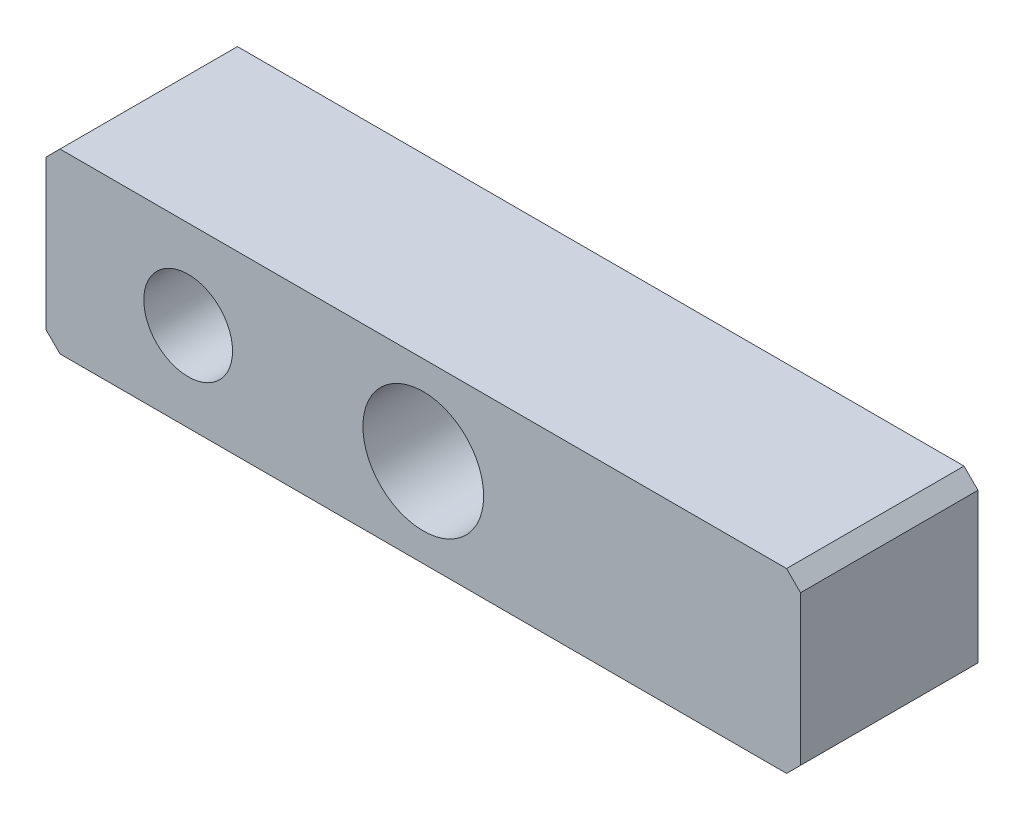
ISO-10303-21;
HEADER;
FILE_DESCRIPTION(('STEP AP214'),'2;1');
FILE_NAME('part.step','',(''),(''),'','','');
FILE_SCHEMA(('AUTOMOTIVE_DESIGN { 1 0 10303 214 1 1 1 1 }'));
ENDSEC;
DATA;
#1=APPLICATION_CONTEXT('core data for automotive mechanical design processes');
#2=APPLICATION_PROTOCOL_DEFINITION('international standard','automotive_design',2000,#1);
#3=PRODUCT_CONTEXT('',#1,'mechanical');
#4=PRODUCT('Part','Part','',(#3));
#5=PRODUCT_RELATED_PRODUCT_CATEGORY('part','',(#4));
#6=PRODUCT_DEFINITION_FORMATION('','',#4);
#7=PRODUCT_DEFINITION_CONTEXT('part definition',#1,'design');
#8=PRODUCT_DEFINITION('design','',#6,#7);
#9=PRODUCT_DEFINITION_SHAPE('','',#8);
#10=(LENGTH_UNIT() NAMED_UNIT(*) SI_UNIT(.MILLI.,.METRE.));
#11=(NAMED_UNIT(*) PLANE_ANGLE_UNIT() SI_UNIT($,.RADIAN.));
#12=(NAMED_UNIT(*) SI_UNIT($,.STERADIAN.) SOLID_ANGLE_UNIT());
#13=UNCERTAINTY_MEASURE_WITH_UNIT(LENGTH_MEASURE(1.E-05),#10,'distance_accuracy_value','');
#14=(GEOMETRIC_REPRESENTATION_CONTEXT(3) GLOBAL_UNCERTAINTY_ASSIGNED_CONTEXT((#13)) GLOBAL_UNIT_ASSIGNED_CONTEXT((#10,
#11,#12)) REPRESENTATION_CONTEXT('',''));
#15=CARTESIAN_POINT('',(0.,0.,0.));
#16=DIRECTION('',(0.,0.,1.));
#17=DIRECTION('',(1.,0.,0.));
#18=AXIS2_PLACEMENT_3D('',#15,#16,#17);
#19=CARTESIAN_POINT('',(0.,6.35,6.35));
#20=DIRECTION('',(0.,0.,-1.));
#21=DIRECTION('',(-1.,0.,0.));
#22=AXIS2_PLACEMENT_3D('',#19,#20,#21);
#23=PLANE('',#22);
#24=DIRECTION('',(0.,-1.,0.));
#25=VECTOR('',#24,1.);
#26=CARTESIAN_POINT('',(0.,0.,6.35));
#27=LINE('',#26,#25);
#28=CARTESIAN_POINT('',(0.,5.85,6.35));
#29=VERTEX_POINT('',#28);
#30=CARTESIAN_POINT('',(0.,0.500000000000004,6.35));
#31=VERTEX_POINT('',#30);
#32=EDGE_CURVE('E136',#29,#31,#27,.T.);
#33=ORIENTED_EDGE('',*,*,#32,.T.);
#34=DIRECTION('',(-0.707106781186545,0.70710678118655,0.));
#35=VECTOR('',#34,1.);
#36=CARTESIAN_POINT('',(0.5,0.,6.35));
#37=LINE('',#36,#35);
#38=CARTESIAN_POINT('',(0.5,0.,6.35));
#39=VERTEX_POINT('',#38);
#40=EDGE_CURVE('E151',#31,#39,#37,.F.);
#41=ORIENTED_EDGE('',*,*,#40,.T.);
#42=DIRECTION('',(1.,0.,0.));
#43=VECTOR('',#42,1.);
#44=CARTESIAN_POINT('',(0.,0.,6.35));
#45=LINE('',#44,#43);
#46=CARTESIAN_POINT('',(26.5,0.,6.35));
#47=VERTEX_POINT('',#46);
#48=EDGE_CURVE('E118',#39,#47,#45,.T.);
#49=ORIENTED_EDGE('',*,*,#48,.T.);
#50=DIRECTION('',(-0.70710678118655,-0.707106781186545,0.));
#51=VECTOR('',#50,1.);
#52=CARTESIAN_POINT('',(27.,0.5,6.35));
#53=LINE('',#52,#51);
#54=CARTESIAN_POINT('',(27.,0.5,6.35));
#55=VERTEX_POINT('',#54);
#56=EDGE_CURVE('E146',#47,#55,#53,.F.);
#57=ORIENTED_EDGE('',*,*,#56,.T.);
#58=DIRECTION('',(0.,1.,0.));
#59=VECTOR('',#58,1.);
#60=CARTESIAN_POINT('',(27.,0.,6.35));
#61=LINE('',#60,#59);
#62=CARTESIAN_POINT('',(27.,5.85,6.35));
#63=VERTEX_POINT('',#62);
#64=EDGE_CURVE('E162',#55,#63,#61,.T.);
#65=ORIENTED_EDGE('',*,*,#64,.T.);
#66=DIRECTION('',(0.707106781186543,-0.707106781186552,0.));
#67=VECTOR('',#66,1.);
#68=CARTESIAN_POINT('',(26.5,6.35,6.35));
#69=LINE('',#68,#67);
#70=CARTESIAN_POINT('',(26.5,6.35,6.35));
#71=VERTEX_POINT('',#70);
#72=EDGE_CURVE('E54',#63,#71,#69,.F.);
#73=ORIENTED_EDGE('',*,*,#72,.T.);
#74=DIRECTION('',(-1.,0.,0.));
#75=VECTOR('',#74,1.);
#76=CARTESIAN_POINT('',(0.,6.35,6.35));
#77=LINE('',#76,#75);
#78=CARTESIAN_POINT('',(0.500000000000004,6.35,6.35));
#79=VERTEX_POINT('',#78);
#80=EDGE_CURVE('E137',#71,#79,#77,.T.);
#81=ORIENTED_EDGE('',*,*,#80,.T.);
#82=DIRECTION('',(0.70710678118655,0.707106781186545,0.));
#83=VECTOR('',#82,1.);
#84=CARTESIAN_POINT('',(0.,5.85,6.35));
#85=LINE('',#84,#83);
#86=EDGE_CURVE('E149',#79,#29,#85,.F.);
#87=ORIENTED_EDGE('',*,*,#86,.T.);
#88=EDGE_LOOP('',(#33,#41,#49,#57,#65,#73,#81,#87));
#89=FACE_BOUND('',#88,.T.);
#90=CARTESIAN_POINT('',(13.5,3.175,6.35));
#91=DIRECTION('',(0.,0.,1.));
#92=DIRECTION('',(1.,0.,0.));
#93=AXIS2_PLACEMENT_3D('',#90,#91,#92);
#94=CIRCLE('',#93,2.16);
#95=CARTESIAN_POINT('',(15.66,3.175,6.35));
#96=VERTEX_POINT('',#95);
#97=EDGE_CURVE('E131',#96,#96,#94,.T.);
#98=ORIENTED_EDGE('',*,*,#97,.F.);
#99=EDGE_LOOP('',(#98));
#100=FACE_BOUND('',#99,.T.);
#101=CARTESIAN_POINT('',(5.0875,3.175,6.35));
#102=DIRECTION('',(0.,0.,1.));
#103=DIRECTION('',(1.,0.,0.));
#104=AXIS2_PLACEMENT_3D('',#101,#102,#103);
#105=CIRCLE('',#104,1.58749999999998);
#106=CARTESIAN_POINT('',(6.67499999999998,3.175,6.35));
#107=VERTEX_POINT('',#106);
#108=EDGE_CURVE('E179',#107,#107,#105,.T.);
#109=ORIENTED_EDGE('',*,*,#108,.F.);
#110=EDGE_LOOP('',(#109));
#111=FACE_BOUND('',#110,.T.);
#112=ADVANCED_FACE('F32',(#89,#100,#111),#23,.F.);
#113=CARTESIAN_POINT('',(0.,6.35,0.));
#114=DIRECTION('',(0.,0.,-1.));
#115=DIRECTION('',(-1.,0.,0.));
#116=AXIS2_PLACEMENT_3D('',#113,#114,#115);
#117=PLANE('',#116);
#118=CARTESIAN_POINT('',(13.5,3.175,0.));
#119=DIRECTION('',(0.,0.,1.));
#120=DIRECTION('',(1.,0.,0.));
#121=AXIS2_PLACEMENT_3D('',#118,#119,#120);
#122=CIRCLE('',#121,2.16);
#123=CARTESIAN_POINT('',(15.66,3.175,0.));
#124=VERTEX_POINT('',#123);
#125=EDGE_CURVE('E176',#124,#124,#122,.T.);
#126=ORIENTED_EDGE('',*,*,#125,.T.);
#127=EDGE_LOOP('',(#126));
#128=FACE_BOUND('',#127,.T.);
#129=DIRECTION('',(1.,0.,0.));
#130=VECTOR('',#129,1.);
#131=CARTESIAN_POINT('',(0.,0.,0.));
#132=LINE('',#131,#130);
#133=CARTESIAN_POINT('',(0.5,0.,0.));
#134=VERTEX_POINT('',#133);
#135=CARTESIAN_POINT('',(26.5,0.,0.));
#136=VERTEX_POINT('',#135);
#137=EDGE_CURVE('E115',#134,#136,#132,.T.);
#138=ORIENTED_EDGE('',*,*,#137,.F.);
#139=DIRECTION('',(0.707106781186545,-0.70710678118655,0.));
#140=VECTOR('',#139,1.);
#141=CARTESIAN_POINT('',(-2.925,3.42500000000002,0.));
#142=LINE('',#141,#140);
#143=CARTESIAN_POINT('',(0.,0.500000000000004,0.));
#144=VERTEX_POINT('',#143);
#145=EDGE_CURVE('E98',#134,#144,#142,.F.);
#146=ORIENTED_EDGE('',*,*,#145,.T.);
#147=DIRECTION('',(0.,-1.,0.));
#148=VECTOR('',#147,1.);
#149=CARTESIAN_POINT('',(0.,0.,0.));
#150=LINE('',#149,#148);
#151=CARTESIAN_POINT('',(0.,5.85,0.));
#152=VERTEX_POINT('',#151);
#153=EDGE_CURVE('E126',#152,#144,#150,.T.);
#154=ORIENTED_EDGE('',*,*,#153,.F.);
#155=DIRECTION('',(-0.70710678118655,-0.707106781186545,0.));
#156=VECTOR('',#155,1.);
#157=CARTESIAN_POINT('',(0.25,6.1,0.));
#158=LINE('',#157,#156);
#159=CARTESIAN_POINT('',(0.500000000000004,6.35,0.));
#160=VERTEX_POINT('',#159);
#161=EDGE_CURVE('E109',#152,#160,#158,.F.);
#162=ORIENTED_EDGE('',*,*,#161,.T.);
#163=DIRECTION('',(-1.,0.,0.));
#164=VECTOR('',#163,1.);
#165=CARTESIAN_POINT('',(0.,6.35,0.));
#166=LINE('',#165,#164);
#167=CARTESIAN_POINT('',(26.5,6.35,0.));
#168=VERTEX_POINT('',#167);
#169=EDGE_CURVE('E129',#168,#160,#166,.T.);
#170=ORIENTED_EDGE('',*,*,#169,.F.);
#171=DIRECTION('',(-0.707106781186543,0.707106781186552,0.));
#172=VECTOR('',#171,1.);
#173=CARTESIAN_POINT('',(13.2500000000002,19.6,0.));
#174=LINE('',#173,#172);
#175=CARTESIAN_POINT('',(27.,5.85,0.));
#176=VERTEX_POINT('',#175);
#177=EDGE_CURVE('E140',#168,#176,#174,.F.);
#178=ORIENTED_EDGE('',*,*,#177,.T.);
#179=DIRECTION('',(0.,1.,0.));
#180=VECTOR('',#179,1.);
#181=CARTESIAN_POINT('',(27.,0.,0.));
#182=LINE('',#181,#180);
#183=CARTESIAN_POINT('',(27.,0.5,0.));
#184=VERTEX_POINT('',#183);
#185=EDGE_CURVE('E125',#184,#176,#182,.T.);
#186=ORIENTED_EDGE('',*,*,#185,.F.);
#187=DIRECTION('',(0.70710678118655,0.707106781186545,0.));
#188=VECTOR('',#187,1.);
#189=CARTESIAN_POINT('',(16.4249999999999,-10.075,0.));
#190=LINE('',#189,#188);
#191=EDGE_CURVE('E119',#184,#136,#190,.F.);
#192=ORIENTED_EDGE('',*,*,#191,.T.);
#193=EDGE_LOOP('',(#138,#146,#154,#162,#170,#178,#186,#192));
#194=FACE_BOUND('',#193,.T.);
#195=CARTESIAN_POINT('',(5.0875,3.175,0.));
#196=DIRECTION('',(0.,0.,1.));
#197=DIRECTION('',(1.,0.,0.));
#198=AXIS2_PLACEMENT_3D('',#195,#196,#197);
#199=CIRCLE('',#198,1.58749999999998);
#200=CARTESIAN_POINT('',(6.67499999999998,3.175,0.));
#201=VERTEX_POINT('',#200);
#202=EDGE_CURVE('E182',#201,#201,#199,.T.);
#203=ORIENTED_EDGE('',*,*,#202,.T.);
#204=EDGE_LOOP('',(#203));
#205=FACE_BOUND('',#204,.T.);
#206=ADVANCED_FACE('F122',(#128,#194,#205),#117,.T.);
#207=CARTESIAN_POINT('',(0.,0.,6.35));
#208=DIRECTION('',(1.,0.,0.));
#209=DIRECTION('',(0.,0.,-1.));
#210=AXIS2_PLACEMENT_3D('',#207,#208,#209);
#211=PLANE('',#210);
#212=ORIENTED_EDGE('',*,*,#153,.T.);
#213=DIRECTION('',(0.,0.,1.));
#214=VECTOR('',#213,1.);
#215=CARTESIAN_POINT('',(0.,0.500000000000004,6.35));
#216=LINE('',#215,#214);
#217=EDGE_CURVE('E103',#144,#31,#216,.T.);
#218=ORIENTED_EDGE('',*,*,#217,.T.);
#219=ORIENTED_EDGE('',*,*,#32,.F.);
#220=DIRECTION('',(0.,0.,-1.));
#221=VECTOR('',#220,1.);
#222=CARTESIAN_POINT('',(0.,5.85,6.35));
#223=LINE('',#222,#221);
#224=EDGE_CURVE('E108',#29,#152,#223,.T.);
#225=ORIENTED_EDGE('',*,*,#224,.T.);
#226=EDGE_LOOP('',(#212,#218,#219,#225));
#227=FACE_BOUND('',#226,.T.);
#228=ADVANCED_FACE('F196',(#227),#211,.F.);
#229=CARTESIAN_POINT('',(0.,0.,6.35));
#230=DIRECTION('',(0.,1.,0.));
#231=DIRECTION('',(0.,0.,1.));
#232=AXIS2_PLACEMENT_3D('',#229,#230,#231);
#233=PLANE('',#232);
#234=ORIENTED_EDGE('',*,*,#48,.F.);
#235=DIRECTION('',(0.,0.,-1.));
#236=VECTOR('',#235,1.);
#237=CARTESIAN_POINT('',(0.5,0.,6.35));
#238=LINE('',#237,#236);
#239=EDGE_CURVE('E102',#39,#134,#238,.T.);
#240=ORIENTED_EDGE('',*,*,#239,.T.);
#241=ORIENTED_EDGE('',*,*,#137,.T.);
#242=DIRECTION('',(0.,0.,1.));
#243=VECTOR('',#242,1.);
#244=CARTESIAN_POINT('',(26.5,0.,6.35));
#245=LINE('',#244,#243);
#246=EDGE_CURVE('E120',#136,#47,#245,.T.);
#247=ORIENTED_EDGE('',*,*,#246,.T.);
#248=EDGE_LOOP('',(#234,#240,#241,#247));
#249=FACE_BOUND('',#248,.T.);
#250=ADVANCED_FACE('F114',(#249),#233,.F.);
#251=CARTESIAN_POINT('',(27.,0.,6.35));
#252=DIRECTION('',(-1.,0.,0.));
#253=DIRECTION('',(0.,0.,1.));
#254=AXIS2_PLACEMENT_3D('',#251,#252,#253);
#255=PLANE('',#254);
#256=ORIENTED_EDGE('',*,*,#185,.T.);
#257=DIRECTION('',(0.,0.,1.));
#258=VECTOR('',#257,1.);
#259=CARTESIAN_POINT('',(27.,5.85,6.35));
#260=LINE('',#259,#258);
#261=EDGE_CURVE('E11',#176,#63,#260,.T.);
#262=ORIENTED_EDGE('',*,*,#261,.T.);
#263=ORIENTED_EDGE('',*,*,#64,.F.);
#264=DIRECTION('',(0.,0.,-1.));
#265=VECTOR('',#264,1.);
#266=CARTESIAN_POINT('',(27.,0.5,6.35));
#267=LINE('',#266,#265);
#268=EDGE_CURVE('E40',#55,#184,#267,.T.);
#269=ORIENTED_EDGE('',*,*,#268,.T.);
#270=EDGE_LOOP('',(#256,#262,#263,#269));
#271=FACE_BOUND('',#270,.T.);
#272=ADVANCED_FACE('F160',(#271),#255,.F.);
#273=CARTESIAN_POINT('',(0.,6.35,6.35));
#274=DIRECTION('',(0.,-1.,0.));
#275=DIRECTION('',(0.,0.,-1.));
#276=AXIS2_PLACEMENT_3D('',#273,#274,#275);
#277=PLANE('',#276);
#278=ORIENTED_EDGE('',*,*,#169,.T.);
#279=DIRECTION('',(0.,0.,1.));
#280=VECTOR('',#279,1.);
#281=CARTESIAN_POINT('',(0.500000000000004,6.35,6.35));
#282=LINE('',#281,#280);
#283=EDGE_CURVE('E47',#160,#79,#282,.T.);
#284=ORIENTED_EDGE('',*,*,#283,.T.);
#285=ORIENTED_EDGE('',*,*,#80,.F.);
#286=DIRECTION('',(0.,0.,-1.));
#287=VECTOR('',#286,1.);
#288=CARTESIAN_POINT('',(26.5,6.35,6.35));
#289=LINE('',#288,#287);
#290=EDGE_CURVE('E153',#71,#168,#289,.T.);
#291=ORIENTED_EDGE('',*,*,#290,.T.);
#292=EDGE_LOOP('',(#278,#284,#285,#291));
#293=FACE_BOUND('',#292,.T.);
#294=ADVANCED_FACE('F169',(#293),#277,.F.);
#295=CARTESIAN_POINT('',(13.5,3.175,6.35));
#296=DIRECTION('',(0.,0.,-1.));
#297=DIRECTION('',(-1.,0.,0.));
#298=AXIS2_PLACEMENT_3D('',#295,#296,#297);
#299=CYLINDRICAL_SURFACE('',#298,2.16);
#300=ORIENTED_EDGE('',*,*,#97,.T.);
#301=EDGE_LOOP('',(#300));
#302=FACE_BOUND('',#301,.T.);
#303=ORIENTED_EDGE('',*,*,#125,.F.);
#304=EDGE_LOOP('',(#303));
#305=FACE_BOUND('',#304,.T.);
#306=ADVANCED_FACE('F201',(#302,#305),#299,.F.);
#307=CARTESIAN_POINT('',(5.0875,3.175,6.35));
#308=DIRECTION('',(0.,0.,-1.));
#309=DIRECTION('',(-1.,0.,0.));
#310=AXIS2_PLACEMENT_3D('',#307,#308,#309);
#311=CYLINDRICAL_SURFACE('',#310,1.58749999999998);
#312=ORIENTED_EDGE('',*,*,#108,.T.);
#313=EDGE_LOOP('',(#312));
#314=FACE_BOUND('',#313,.T.);
#315=ORIENTED_EDGE('',*,*,#202,.F.);
#316=EDGE_LOOP('',(#315));
#317=FACE_BOUND('',#316,.T.);
#318=ADVANCED_FACE('F188',(#314,#317),#311,.F.);
#319=CARTESIAN_POINT('',(0.5,0.,6.35));
#320=DIRECTION('',(0.70710678118655,0.707106781186545,0.));
#321=DIRECTION('',(0.,0.,-1.));
#322=AXIS2_PLACEMENT_3D('',#319,#320,#321);
#323=PLANE('',#322);
#324=ORIENTED_EDGE('',*,*,#40,.F.);
#325=ORIENTED_EDGE('',*,*,#217,.F.);
#326=ORIENTED_EDGE('',*,*,#145,.F.);
#327=ORIENTED_EDGE('',*,*,#239,.F.);
#328=EDGE_LOOP('',(#324,#325,#326,#327));
#329=FACE_BOUND('',#328,.T.);
#330=ADVANCED_FACE('F101',(#329),#323,.F.);
#331=CARTESIAN_POINT('',(0.,5.85,6.35));
#332=DIRECTION('',(0.707106781186545,-0.70710678118655,0.));
#333=DIRECTION('',(0.,0.,-1.));
#334=AXIS2_PLACEMENT_3D('',#331,#332,#333);
#335=PLANE('',#334);
#336=ORIENTED_EDGE('',*,*,#86,.F.);
#337=ORIENTED_EDGE('',*,*,#283,.F.);
#338=ORIENTED_EDGE('',*,*,#161,.F.);
#339=ORIENTED_EDGE('',*,*,#224,.F.);
#340=EDGE_LOOP('',(#336,#337,#338,#339));
#341=FACE_BOUND('',#340,.T.);
#342=ADVANCED_FACE('F215',(#341),#335,.F.);
#343=CARTESIAN_POINT('',(26.5,6.35,6.35));
#344=DIRECTION('',(-0.707106781186552,-0.707106781186543,0.));
#345=DIRECTION('',(0.,0.,-1.));
#346=AXIS2_PLACEMENT_3D('',#343,#344,#345);
#347=PLANE('',#346);
#348=ORIENTED_EDGE('',*,*,#72,.F.);
#349=ORIENTED_EDGE('',*,*,#261,.F.);
#350=ORIENTED_EDGE('',*,*,#177,.F.);
#351=ORIENTED_EDGE('',*,*,#290,.F.);
#352=EDGE_LOOP('',(#348,#349,#350,#351));
#353=FACE_BOUND('',#352,.T.);
#354=ADVANCED_FACE('F168',(#353),#347,.F.);
#355=CARTESIAN_POINT('',(27.,0.5,6.35));
#356=DIRECTION('',(-0.707106781186545,0.70710678118655,0.));
#357=DIRECTION('',(0.,0.,-1.));
#358=AXIS2_PLACEMENT_3D('',#355,#356,#357);
#359=PLANE('',#358);
#360=ORIENTED_EDGE('',*,*,#56,.F.);
#361=ORIENTED_EDGE('',*,*,#246,.F.);
#362=ORIENTED_EDGE('',*,*,#191,.F.);
#363=ORIENTED_EDGE('',*,*,#268,.F.);
#364=EDGE_LOOP('',(#360,#361,#362,#363));
#365=FACE_BOUND('',#364,.T.);
#366=ADVANCED_FACE('F34',(#365),#359,.F.);
#367=CLOSED_SHELL('',(#112,#206,#228,#250,#272,#294,#306,#318,#330,#342,#354,#366));
#368=MANIFOLD_SOLID_BREP('B2',#367);
#369=ADVANCED_BREP_SHAPE_REPRESENTATION('',(#18,#368),#14);
#370=SHAPE_DEFINITION_REPRESENTATION(#9,#369);
ENDSEC;
END-ISO-10303-21;
